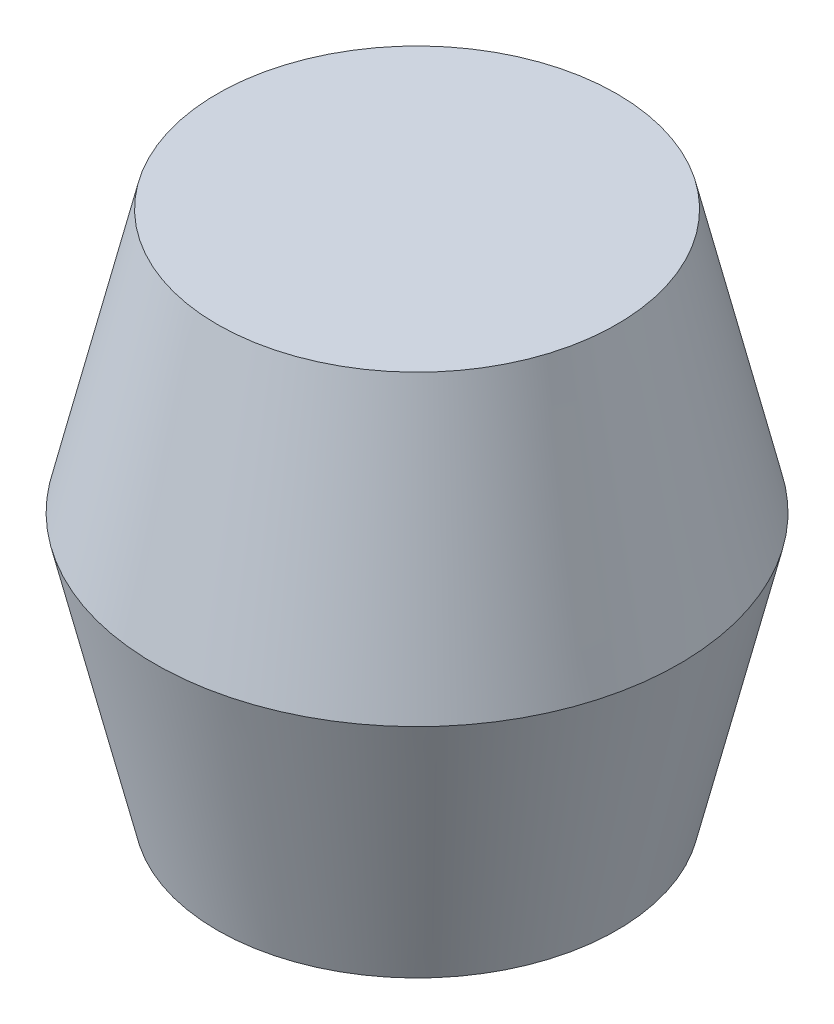
ISO-10303-21;
HEADER;
FILE_DESCRIPTION(('STEP AP214'),'2;1');
FILE_NAME('part.step','',(''),(''),'','','');
FILE_SCHEMA(('AUTOMOTIVE_DESIGN { 1 0 10303 214 1 1 1 1 }'));
ENDSEC;
DATA;
#1=APPLICATION_CONTEXT('core data for automotive mechanical design processes');
#2=APPLICATION_PROTOCOL_DEFINITION('international standard','automotive_design',2000,#1);
#3=PRODUCT_CONTEXT('',#1,'mechanical');
#4=PRODUCT('Part','Part','',(#3));
#5=PRODUCT_RELATED_PRODUCT_CATEGORY('part','',(#4));
#6=PRODUCT_DEFINITION_FORMATION('','',#4);
#7=PRODUCT_DEFINITION_CONTEXT('part definition',#1,'design');
#8=PRODUCT_DEFINITION('design','',#6,#7);
#9=PRODUCT_DEFINITION_SHAPE('','',#8);
#10=(LENGTH_UNIT() NAMED_UNIT(*) SI_UNIT(.MILLI.,.METRE.));
#11=(NAMED_UNIT(*) PLANE_ANGLE_UNIT() SI_UNIT($,.RADIAN.));
#12=(NAMED_UNIT(*) SI_UNIT($,.STERADIAN.) SOLID_ANGLE_UNIT());
#13=UNCERTAINTY_MEASURE_WITH_UNIT(LENGTH_MEASURE(1.E-05),#10,'distance_accuracy_value','');
#14=(GEOMETRIC_REPRESENTATION_CONTEXT(3) GLOBAL_UNCERTAINTY_ASSIGNED_CONTEXT((#13)) GLOBAL_UNIT_ASSIGNED_CONTEXT((#10,
#11,#12)) REPRESENTATION_CONTEXT('',''));
#15=CARTESIAN_POINT('',(0.,0.,0.));
#16=DIRECTION('',(0.,0.,1.));
#17=DIRECTION('',(1.,0.,0.));
#18=AXIS2_PLACEMENT_3D('',#15,#16,#17);
#19=CARTESIAN_POINT('',(0.,6.35,0.));
#20=DIRECTION('',(0.,-1.,0.));
#21=DIRECTION('',(0.,0.,-1.));
#22=AXIS2_PLACEMENT_3D('',#19,#20,#21);
#23=PLANE('',#22);
#24=CARTESIAN_POINT('',(0.,6.35,0.));
#25=DIRECTION('',(0.,-1.,0.));
#26=DIRECTION('',(0.,0.,-1.));
#27=AXIS2_PLACEMENT_3D('',#24,#25,#26);
#28=CIRCLE('',#27,1.1811);
#29=CARTESIAN_POINT('',(0.,6.35,-1.1811));
#30=VERTEX_POINT('',#29);
#31=EDGE_CURVE('E10',#30,#30,#28,.T.);
#32=ORIENTED_EDGE('',*,*,#31,.T.);
#33=EDGE_LOOP('',(#32));
#34=FACE_BOUND('',#33,.T.);
#35=ADVANCED_FACE('F33',(#34),#23,.T.);
#36=CARTESIAN_POINT('',(0.,0.,0.));
#37=DIRECTION('',(0.,-1.,0.));
#38=DIRECTION('',(0.,0.,-1.));
#39=AXIS2_PLACEMENT_3D('',#36,#37,#38);
#40=CYLINDRICAL_SURFACE('',#39,1.1811);
#41=CARTESIAN_POINT('',(0.,0.,0.));
#42=DIRECTION('',(0.,-1.,0.));
#43=DIRECTION('',(0.,0.,-1.));
#44=AXIS2_PLACEMENT_3D('',#41,#42,#43);
#45=CIRCLE('',#44,1.1811);
#46=CARTESIAN_POINT('',(0.,0.,-1.1811));
#47=VERTEX_POINT('',#46);
#48=EDGE_CURVE('E39',#47,#47,#45,.T.);
#49=ORIENTED_EDGE('',*,*,#48,.T.);
#50=EDGE_LOOP('',(#49));
#51=FACE_BOUND('',#50,.T.);
#52=ORIENTED_EDGE('',*,*,#31,.F.);
#53=EDGE_LOOP('',(#52));
#54=FACE_BOUND('',#53,.T.);
#55=ADVANCED_FACE('F68',(#51,#54),#40,.F.);
#56=CARTESIAN_POINT('',(0.,0.,-1.1811));
#57=DIRECTION('',(0.,-1.,0.));
#58=DIRECTION('',(0.,0.,-1.));
#59=AXIS2_PLACEMENT_3D('',#56,#57,#58);
#60=PLANE('',#59);
#61=CARTESIAN_POINT('',(0.,0.,0.));
#62=DIRECTION('',(0.,-1.,0.));
#63=DIRECTION('',(0.,0.,-1.));
#64=AXIS2_PLACEMENT_3D('',#61,#62,#63);
#65=CIRCLE('',#64,3.0226);
#66=CARTESIAN_POINT('',(0.,0.,-3.0226));
#67=VERTEX_POINT('',#66);
#68=EDGE_CURVE('E43',#67,#67,#65,.T.);
#69=ORIENTED_EDGE('',*,*,#68,.T.);
#70=EDGE_LOOP('',(#69));
#71=FACE_BOUND('',#70,.T.);
#72=ORIENTED_EDGE('',*,*,#48,.F.);
#73=EDGE_LOOP('',(#72));
#74=FACE_BOUND('',#73,.T.);
#75=ADVANCED_FACE('F72',(#71,#74),#60,.T.);
#76=CARTESIAN_POINT('',(0.,0.,0.));
#77=DIRECTION('',(0.,1.,0.));
#78=DIRECTION('',(0.,0.,1.));
#79=AXIS2_PLACEMENT_3D('',#76,#77,#78);
#80=CONICAL_SURFACE('',#79,3.0226,0.234393047193764);
#81=CARTESIAN_POINT('',(0.,3.9624,0.));
#82=DIRECTION('',(0.,-1.,0.));
#83=DIRECTION('',(0.,0.,-1.));
#84=AXIS2_PLACEMENT_3D('',#81,#82,#83);
#85=CIRCLE('',#84,3.96875);
#86=CARTESIAN_POINT('',(0.,3.9624,-3.96875));
#87=VERTEX_POINT('',#86);
#88=EDGE_CURVE('E47',#87,#87,#85,.T.);
#89=ORIENTED_EDGE('',*,*,#88,.T.);
#90=EDGE_LOOP('',(#89));
#91=FACE_BOUND('',#90,.T.);
#92=ORIENTED_EDGE('',*,*,#68,.F.);
#93=EDGE_LOOP('',(#92));
#94=FACE_BOUND('',#93,.T.);
#95=ADVANCED_FACE('F65',(#91,#94),#80,.T.);
#96=CARTESIAN_POINT('',(0.,3.9624,0.));
#97=DIRECTION('',(0.,-1.,0.));
#98=DIRECTION('',(0.,0.,-1.));
#99=AXIS2_PLACEMENT_3D('',#96,#97,#98);
#100=CONICAL_SURFACE('',#99,3.96875,0.233671191811363);
#101=CARTESIAN_POINT('',(0.,7.9375,0.));
#102=DIRECTION('',(0.,-1.,0.));
#103=DIRECTION('',(0.,0.,-1.));
#104=AXIS2_PLACEMENT_3D('',#101,#102,#103);
#105=CIRCLE('',#104,3.0226);
#106=CARTESIAN_POINT('',(0.,7.9375,-3.0226));
#107=VERTEX_POINT('',#106);
#108=EDGE_CURVE('E52',#107,#107,#105,.T.);
#109=ORIENTED_EDGE('',*,*,#108,.T.);
#110=EDGE_LOOP('',(#109));
#111=FACE_BOUND('',#110,.T.);
#112=ORIENTED_EDGE('',*,*,#88,.F.);
#113=EDGE_LOOP('',(#112));
#114=FACE_BOUND('',#113,.T.);
#115=ADVANCED_FACE('F56',(#111,#114),#100,.T.);
#116=CARTESIAN_POINT('',(0.,7.9375,-3.0226));
#117=DIRECTION('',(0.,1.,0.));
#118=DIRECTION('',(0.,0.,1.));
#119=AXIS2_PLACEMENT_3D('',#116,#117,#118);
#120=PLANE('',#119);
#121=ORIENTED_EDGE('',*,*,#108,.F.);
#122=EDGE_LOOP('',(#121));
#123=FACE_BOUND('',#122,.T.);
#124=ADVANCED_FACE('F59',(#123),#120,.T.);
#125=CLOSED_SHELL('',(#35,#55,#75,#95,#115,#124));
#126=MANIFOLD_SOLID_BREP('B2',#125);
#127=ADVANCED_BREP_SHAPE_REPRESENTATION('',(#18,#126),#14);
#128=SHAPE_DEFINITION_REPRESENTATION(#9,#127);
ENDSEC;
END-ISO-10303-21;
